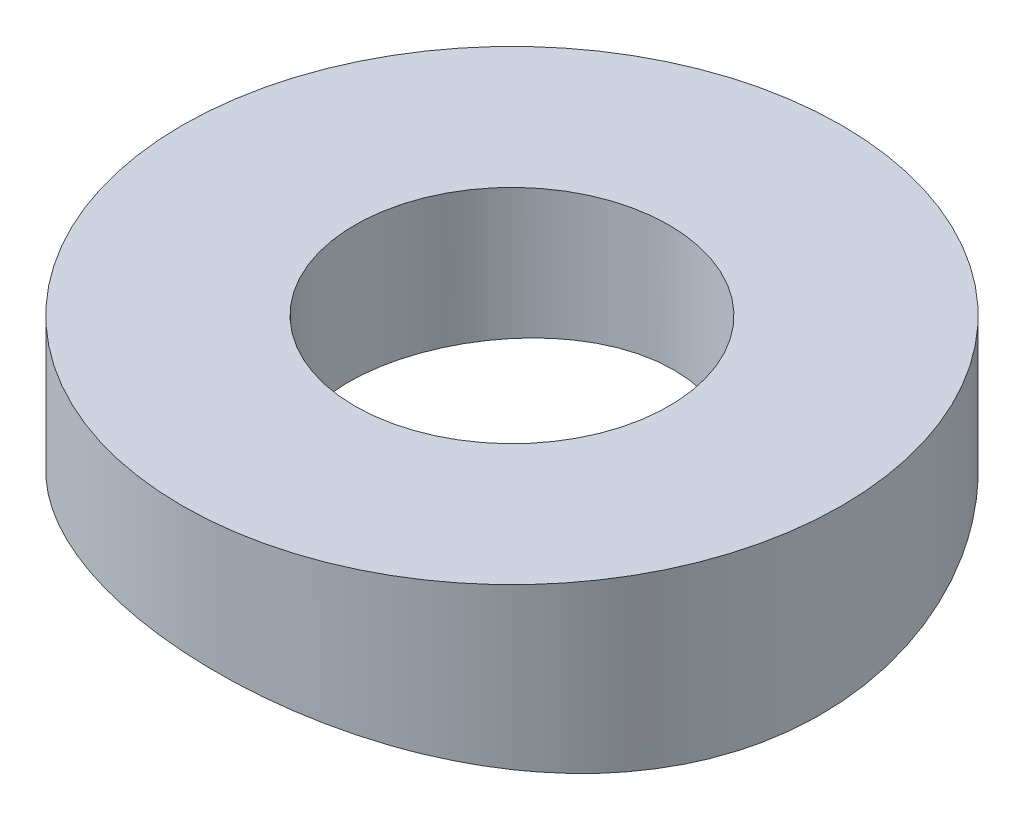
ISO-10303-21;
HEADER;
FILE_DESCRIPTION(('STEP AP214'),'2;1');
FILE_NAME('part.step','',(''),(''),'','','');
FILE_SCHEMA(('AUTOMOTIVE_DESIGN { 1 0 10303 214 1 1 1 1 }'));
ENDSEC;
DATA;
#1=APPLICATION_CONTEXT('core data for automotive mechanical design processes');
#2=APPLICATION_PROTOCOL_DEFINITION('international standard','automotive_design',2000,#1);
#3=PRODUCT_CONTEXT('',#1,'mechanical');
#4=PRODUCT('Part','Part','',(#3));
#5=PRODUCT_RELATED_PRODUCT_CATEGORY('part','',(#4));
#6=PRODUCT_DEFINITION_FORMATION('','',#4);
#7=PRODUCT_DEFINITION_CONTEXT('part definition',#1,'design');
#8=PRODUCT_DEFINITION('design','',#6,#7);
#9=PRODUCT_DEFINITION_SHAPE('','',#8);
#10=(LENGTH_UNIT() NAMED_UNIT(*) SI_UNIT(.MILLI.,.METRE.));
#11=(NAMED_UNIT(*) PLANE_ANGLE_UNIT() SI_UNIT($,.RADIAN.));
#12=(NAMED_UNIT(*) SI_UNIT($,.STERADIAN.) SOLID_ANGLE_UNIT());
#13=UNCERTAINTY_MEASURE_WITH_UNIT(LENGTH_MEASURE(1.E-05),#10,'distance_accuracy_value','');
#14=(GEOMETRIC_REPRESENTATION_CONTEXT(3) GLOBAL_UNCERTAINTY_ASSIGNED_CONTEXT((#13)) GLOBAL_UNIT_ASSIGNED_CONTEXT((#10,
#11,#12)) REPRESENTATION_CONTEXT('',''));
#15=CARTESIAN_POINT('',(0.,0.,0.));
#16=DIRECTION('',(0.,0.,1.));
#17=DIRECTION('',(1.,0.,0.));
#18=AXIS2_PLACEMENT_3D('',#15,#16,#17);
#19=CARTESIAN_POINT('',(0.,0.5,0.));
#20=DIRECTION('',(0.,1.,0.));
#21=DIRECTION('',(0.,0.,1.));
#22=AXIS2_PLACEMENT_3D('',#19,#20,#21);
#23=PLANE('',#22);
#24=CARTESIAN_POINT('',(0.,0.5,0.));
#25=DIRECTION('',(0.,1.,0.));
#26=DIRECTION('',(0.,0.,1.));
#27=AXIS2_PLACEMENT_3D('',#24,#25,#26);
#28=CIRCLE('',#27,5.25);
#29=CARTESIAN_POINT('',(0.,0.5,5.25));
#30=VERTEX_POINT('',#29);
#31=EDGE_CURVE('E10',#30,#30,#28,.T.);
#32=ORIENTED_EDGE('',*,*,#31,.T.);
#33=EDGE_LOOP('',(#32));
#34=FACE_BOUND('',#33,.T.);
#35=CARTESIAN_POINT('',(0.,0.5,0.));
#36=DIRECTION('',(0.,1.,0.));
#37=DIRECTION('',(0.,0.,1.));
#38=AXIS2_PLACEMENT_3D('',#35,#36,#37);
#39=CIRCLE('',#38,2.49999999999838);
#40=CARTESIAN_POINT('',(0.,0.5,2.49999999999838));
#41=VERTEX_POINT('',#40);
#42=EDGE_CURVE('E45',#41,#41,#39,.T.);
#43=ORIENTED_EDGE('',*,*,#42,.F.);
#44=EDGE_LOOP('',(#43));
#45=FACE_BOUND('',#44,.T.);
#46=ADVANCED_FACE('F37',(#34,#45),#23,.T.);
#47=CARTESIAN_POINT('',(0.,0.5,0.));
#48=DIRECTION('',(0.,-1.,0.));
#49=DIRECTION('',(0.,0.,-1.));
#50=AXIS2_PLACEMENT_3D('',#47,#48,#49);
#51=CYLINDRICAL_SURFACE('',#50,5.25);
#52=ORIENTED_EDGE('',*,*,#31,.F.);
#53=EDGE_LOOP('',(#52));
#54=FACE_BOUND('',#53,.T.);
#55=CARTESIAN_POINT('',(0.,-1.50283224713271,5.25));
#56=CARTESIAN_POINT('',(0.147652765710306,-1.51393663326217,5.25000479325287));
#57=CARTESIAN_POINT('',(0.295127762788347,-1.52666987748998,5.24377066254227));
#58=CARTESIAN_POINT('',(0.588800454093382,-1.55503249876174,5.21895703640621));
#59=CARTESIAN_POINT('',(0.734997964226816,-1.57066228623598,5.20037579047069));
#60=CARTESIAN_POINT('',(1.02508219118432,-1.60438800987724,5.15105492497996));
#61=CARTESIAN_POINT('',(1.16896806387974,-1.62248482501899,5.12031096452442));
#62=CARTESIAN_POINT('',(1.45346290778707,-1.66064904462505,5.04693329353771));
#63=CARTESIAN_POINT('',(1.59407061841492,-1.68071719217031,5.00429508832015));
#64=CARTESIAN_POINT('',(1.87077094923852,-1.72223363697337,4.9075600874473));
#65=CARTESIAN_POINT('',(2.00687183377532,-1.74367916862434,4.85348578227901));
#66=CARTESIAN_POINT('',(2.27399203203094,-1.78740750907438,4.73422534110709));
#67=CARTESIAN_POINT('',(2.40500945697319,-1.80969062313906,4.66903512257355));
#68=CARTESIAN_POINT('',(2.78907255211977,-1.87687892246193,4.45744748321791));
#69=CARTESIAN_POINT('',(3.03341864263701,-1.92216844825496,4.29493144745056));
#70=CARTESIAN_POINT('',(3.49658693796118,-2.00960958060768,3.92754171507278));
#71=CARTESIAN_POINT('',(3.71480358492105,-2.05168068566105,3.72188857441577));
#72=CARTESIAN_POINT('',(4.11378301744051,-2.12667965653291,3.27548463574664));
#73=CARTESIAN_POINT('',(4.29455203022198,-2.15960904285146,3.03473968456475));
#74=CARTESIAN_POINT('',(4.60957542032394,-2.21162017824754,2.53002011854625));
#75=CARTESIAN_POINT('',(4.74470226299247,-2.23097033048144,2.26661856057025));
#76=CARTESIAN_POINT('',(4.96892316468542,-2.25439894156032,1.72029516885201));
#77=CARTESIAN_POINT('',(5.05803054477787,-2.25848182189877,1.43737901083204));
#78=CARTESIAN_POINT('',(5.18477825878008,-2.25100683329315,0.872383700755164));
#79=CARTESIAN_POINT('',(5.22433390346927,-2.24006778566312,0.590723341511633));
#80=CARTESIAN_POINT('',(5.25756524796937,-2.20497127693655,0.0255478489936507));
#81=CARTESIAN_POINT('',(5.25123848557693,-2.18081310652201,-0.257967383003788));
#82=CARTESIAN_POINT('',(5.19323409739095,-2.12195032152321,-0.820454763689445));
#83=CARTESIAN_POINT('',(5.14135173467222,-2.0871985578714,-1.09940060409208));
#84=CARTESIAN_POINT('',(4.99378395906723,-2.01101731901197,-1.64450618888744));
#85=CARTESIAN_POINT('',(4.89808833371829,-1.96958628838908,-1.91066293627105));
#86=CARTESIAN_POINT('',(4.66061034907422,-1.8825848833207,-2.43461220861466));
#87=CARTESIAN_POINT('',(4.51707397663303,-1.83691396741706,-2.69159425015787));
#88=CARTESIAN_POINT('',(4.1888979980221,-1.74797450362881,-3.17833351595849));
#89=CARTESIAN_POINT('',(4.00425331161295,-1.70470625349641,-3.40808736992543));
#90=CARTESIAN_POINT('',(3.59524928665211,-1.62463045358851,-3.83743398200973));
#91=CARTESIAN_POINT('',(3.37032290430443,-1.58793248344051,-4.03650861489725));
#92=CARTESIAN_POINT('',(2.88880314955733,-1.52600059766014,-4.39399202680978));
#93=CARTESIAN_POINT('',(2.63221772504671,-1.50076381215503,-4.5524109816628));
#94=CARTESIAN_POINT('',(2.10347903201642,-1.46526125354077,-4.81899595162568));
#95=CARTESIAN_POINT('',(1.83208296299062,-1.45454380333699,-4.92860317476767));
#96=CARTESIAN_POINT('',(1.27471304832574,-1.44779971171288,-5.10124321269341));
#97=CARTESIAN_POINT('',(0.98874184650722,-1.45177041525822,-5.16428444228643));
#98=CARTESIAN_POINT('',(0.419201397773205,-1.4736254399165,-5.24089521025491));
#99=CARTESIAN_POINT('',(0.135798791195952,-1.49110714452453,-5.2558327409671));
#100=CARTESIAN_POINT('',(-0.428755477906114,-1.53765970958948,-5.24007962450734));
#101=CARTESIAN_POINT('',(-0.709906945603988,-1.56673156230041,-5.20938507007405));
#102=CARTESIAN_POINT('',(-1.26714479723721,-1.63405032217261,-5.10280615322116));
#103=CARTESIAN_POINT('',(-1.54307448293746,-1.67243873354295,-5.02619509797609));
#104=CARTESIAN_POINT('',(-2.07824260100166,-1.75420595863635,-4.82956781505799));
#105=CARTESIAN_POINT('',(-2.33747691740768,-1.79758599566959,-4.70954093184465));
#106=CARTESIAN_POINT('',(-2.84253314110295,-1.8866029837088,-4.42378337554925));
#107=CARTESIAN_POINT('',(-3.08746338840706,-1.9322628144159,-4.25648084332879));
#108=CARTESIAN_POINT('',(-3.54620432727373,-2.01911737370939,-3.88258867583062));
#109=CARTESIAN_POINT('',(-3.76001331738729,-2.06031185813674,-3.67599689396986));
#110=CARTESIAN_POINT('',(-4.15124743859227,-2.13355998700734,-3.22776690189872));
#111=CARTESIAN_POINT('',(-4.32851470161876,-2.16557419415283,-2.98598402091961));
#112=CARTESIAN_POINT('',(-4.63977698517769,-2.21617368607563,-2.47476174005913));
#113=CARTESIAN_POINT('',(-4.77378674486611,-2.23476354761514,-2.20533180170195));
#114=CARTESIAN_POINT('',(-4.98962642584803,-2.25563573606303,-1.65807378559484));
#115=CARTESIAN_POINT('',(-5.07331160959048,-2.25853436455062,-1.38100013227663));
#116=CARTESIAN_POINT('',(-5.1940249427223,-2.24932116606658,-0.817135469855133));
#117=CARTESIAN_POINT('',(-5.23105774282904,-2.23721083555797,-0.53034543229344));
#118=CARTESIAN_POINT('',(-5.25741307367904,-2.19989909733474,0.0383954010539523));
#119=CARTESIAN_POINT('',(-5.24772684552044,-2.17497961007166,0.320320458929155));
#120=CARTESIAN_POINT('',(-5.18367483512661,-2.11507133831735,0.877952874975825));
#121=CARTESIAN_POINT('',(-5.12930138815035,-2.08008082711556,1.15365915816889));
#122=CARTESIAN_POINT('',(-4.97536910530781,-2.00262470810087,1.70041032759132));
#123=CARTESIAN_POINT('',(-4.87446189294901,-1.95996101310665,1.9710458180013));
#124=CARTESIAN_POINT('',(-4.62979210422877,-1.87253238046081,2.49204234150143));
#125=CARTESIAN_POINT('',(-4.48601997969042,-1.82776697652644,2.742398841621));
#126=CARTESIAN_POINT('',(-4.23822695668057,-1.76183597842736,3.1019675652115));
#127=CARTESIAN_POINT('',(-4.14844605688129,-1.73969503211196,3.22104915415993));
#128=CARTESIAN_POINT('',(-3.95896493562291,-1.69672516274637,3.45127330671804));
#129=CARTESIAN_POINT('',(-3.85926837416428,-1.67589576019035,3.56241877382166));
#130=CARTESIAN_POINT('',(-3.65054502909402,-1.63612488304628,3.77602129608223));
#131=CARTESIAN_POINT('',(-3.54151448885923,-1.61718417529859,3.8784748196722));
#132=CARTESIAN_POINT('',(-3.31491965357565,-1.58174292005662,4.07383999162318));
#133=CARTESIAN_POINT('',(-3.19735896004393,-1.56524135156821,4.1667556274238));
#134=CARTESIAN_POINT('',(-2.95596881799948,-1.53532911163889,4.34127355993746));
#135=CARTESIAN_POINT('',(-2.83223419109465,-1.52188293915798,4.42300088468183));
#136=CARTESIAN_POINT('',(-2.57811570680729,-1.49821255114927,4.57578314344685));
#137=CARTESIAN_POINT('',(-2.44773455057756,-1.48798703868227,4.64684236739509));
#138=CARTESIAN_POINT('',(-2.18127615134274,-1.47105033900093,4.77771385197785));
#139=CARTESIAN_POINT('',(-2.04520107032395,-1.46433783074151,4.83753033494996));
#140=CARTESIAN_POINT('',(-1.76839711387578,-1.45461389936946,4.94543797148374));
#141=CARTESIAN_POINT('',(-1.62766878962834,-1.45160203951212,4.99353050815003));
#142=CARTESIAN_POINT('',(-1.24428198577865,-1.44861639941599,5.1065838111067));
#143=CARTESIAN_POINT('',(-0.99818892274556,-1.4521647584509,5.16034237157682));
#144=CARTESIAN_POINT('',(-0.501226942785609,-1.46985835408988,5.23204676965219));
#145=CARTESIAN_POINT('',(-0.250357927997903,-1.48400380806023,5.24999187262866));
#146=CARTESIAN_POINT('',(0.,-1.50283224713271,5.25));
#147=B_SPLINE_CURVE_WITH_KNOTS('',3,(#55,#56,#57,#58,#59,#60,#61,#62,#63,#64,#65,#66,#67,#68,
#69,#70,#71,#72,#73,#74,#75,#76,#77,#78,#79,#80,#81,#82,#83,#84,#85,#86,#87,#88,#89,#90,#91,#92,
#93,#94,#95,#96,#97,#98,#99,#100,#101,#102,#103,#104,#105,#106,#107,#108,#109,#110,#111,#112,
#113,#114,#115,#116,#117,#118,#119,#120,#121,#122,#123,#124,#125,#126,#127,#128,#129,#130,#131,
#132,#133,#134,#135,#136,#137,#138,#139,#140,#141,#142,#143,#144,#145,#146),.UNSPECIFIED.,.T.,
.F.,(4,2,2,2,2,2,2,2,2,2,2,2,2,2,2,2,2,2,2,2,2,2,2,2,2,2,2,2,2,2,2,2,2,2,2,2,2,2,2,2,2,2,2,2,2,
4),(0.,0.443977148082651,0.888017254380359,1.33221598277543,1.77658279623435,2.22008370204813,
2.66374784419911,3.550156637562,4.45422681571982,5.35814653382889,6.24365410091631,
7.12890519983242,7.97876221204383,8.82866483076099,9.68240676287434,10.5363477956576,
11.4258668100482,12.3154958138795,13.2188049361487,14.1218877455556,14.9961768799306,
15.8703079853066,16.7193499794243,17.5684646772116,18.4313863989966,19.2945200513933,
20.1906519292997,21.0868327817844,21.986807733259,22.8864757112242,23.7505365408833,
24.6145112265886,25.4602365416933,26.3061069456816,27.1781969516142,28.0504813612757,
28.502339029809,28.9540305264197,29.405904676603,29.8575891388128,30.3037213258282,
30.749673627884,31.1954581114194,31.6411899791153,32.3939758708094,33.1467772039756),.UNSPECIFIED.);
#148=CARTESIAN_POINT('',(0.,-1.50283224713271,5.25));
#149=VERTEX_POINT('',#148);
#150=EDGE_CURVE('E57',#149,#149,#147,.T.);
#151=ORIENTED_EDGE('',*,*,#150,.T.);
#152=EDGE_LOOP('',(#151));
#153=FACE_BOUND('',#152,.T.);
#154=ADVANCED_FACE('F39',(#54,#153),#51,.T.);
#155=CARTESIAN_POINT('',(0.,0.5,0.));
#156=DIRECTION('',(0.,-1.,0.));
#157=DIRECTION('',(0.,0.,-1.));
#158=AXIS2_PLACEMENT_3D('',#155,#156,#157);
#159=CYLINDRICAL_SURFACE('',#158,2.49999999999838);
#160=ORIENTED_EDGE('',*,*,#42,.T.);
#161=EDGE_LOOP('',(#160));
#162=FACE_BOUND('',#161,.T.);
#163=CARTESIAN_POINT('',(0.,-1.46196610857536,2.49999999999838));
#164=CARTESIAN_POINT('',(0.140470364218208,-1.46698804409764,2.49999417829248));
#165=CARTESIAN_POINT('',(0.280974341060903,-1.47349046657698,2.48812165829915));
#166=CARTESIAN_POINT('',(0.557981582243768,-1.48873464586083,2.4409911450548));
#167=CARTESIAN_POINT('',(0.694480321661717,-1.49747883437423,2.40570769086061));
#168=CARTESIAN_POINT('',(0.95946296025064,-1.51621733903422,2.31281661665283));
#169=CARTESIAN_POINT('',(1.08795255864686,-1.52621075066878,2.25522508632974));
#170=CARTESIAN_POINT('',(1.33343060964942,-1.54633648094252,2.11934958462091));
#171=CARTESIAN_POINT('',(1.45042130714312,-1.55646877202692,2.04106966320418));
#172=CARTESIAN_POINT('',(1.6701693087071,-1.57578237311672,1.86558038079526));
#173=CARTESIAN_POINT('',(1.77286196004835,-1.58495931894086,1.76828953161828));
#174=CARTESIAN_POINT('',(1.96047049395343,-1.60126337260419,1.55770337094314));
#175=CARTESIAN_POINT('',(2.04538645582268,-1.60839048958813,1.4444081308476));
#176=CARTESIAN_POINT('',(2.19460010732371,-1.61974238671432,1.20559458846543));
#177=CARTESIAN_POINT('',(2.25899504687868,-1.62398096802165,1.08013772765399));
#178=CARTESIAN_POINT('',(2.36582415361848,-1.62911836681179,0.820137874194329));
#179=CARTESIAN_POINT('',(2.40825964903966,-1.63001738631126,0.685595431652151));
#180=CARTESIAN_POINT('',(2.46966579861413,-1.62837865391994,0.412514212005522));
#181=CARTESIAN_POINT('',(2.488837287556,-1.62587071923329,0.274020359374918));
#182=CARTESIAN_POINT('',(2.50387351975846,-1.61775858524573,-0.00413372667384024));
#183=CARTESIAN_POINT('',(2.49973809803221,-1.61215436402683,-0.143793968341736));
#184=CARTESIAN_POINT('',(2.4683164144177,-1.59847851837837,-0.420505939546786));
#185=CARTESIAN_POINT('',(2.4410056204865,-1.59040428513797,-0.557554747540602));
#186=CARTESIAN_POINT('',(2.36401541623247,-1.57269598996446,-0.825113989710893));
#187=CARTESIAN_POINT('',(2.3143346405764,-1.56306183284569,-0.955624024258386));
#188=CARTESIAN_POINT('',(2.19344254362561,-1.54321010577422,-1.2076943662853));
#189=CARTESIAN_POINT('',(2.12203844764318,-1.53298800557986,-1.32916189584458));
#190=CARTESIAN_POINT('',(1.95984191627014,-1.51318513593587,-1.55844138277389));
#191=CARTESIAN_POINT('',(1.86904907784175,-1.50360437982343,-1.6662530562026));
#192=CARTESIAN_POINT('',(1.67027214886788,-1.48612806530482,-1.86548949174515));
#193=CARTESIAN_POINT('',(1.56223665360555,-1.47823771659517,-1.9568634593414));
#194=CARTESIAN_POINT('',(1.33221111186618,-1.46507078209653,-2.12016635821112));
#195=CARTESIAN_POINT('',(1.21022182391018,-1.45979405431549,-2.19209634573519));
#196=CARTESIAN_POINT('',(0.956758548646715,-1.45248153599702,-2.31392154470885));
#197=CARTESIAN_POINT('',(0.825364337067133,-1.45042123919967,-2.3639812577261));
#198=CARTESIAN_POINT('',(0.556045148228915,-1.44969606052153,-2.44140195634057));
#199=CARTESIAN_POINT('',(0.418120446532146,-1.45103103549826,-2.46876389879676));
#200=CARTESIAN_POINT('',(0.140600339255474,-1.4569266439765,-2.49992122454493));
#201=CARTESIAN_POINT('',(0.0010211839644331,-1.46146666513029,-2.50386569341094));
#202=CARTESIAN_POINT('',(-0.276737826910886,-1.47324712445725,-2.48852655208414));
#203=CARTESIAN_POINT('',(-0.414917639316031,-1.48048764569979,-2.46924222731588));
#204=CARTESIAN_POINT('',(-0.686685436206362,-1.49691170789968,-2.40789536517712));
#205=CARTESIAN_POINT('',(-0.820248815898902,-1.50610421181422,-2.36572630818762));
#206=CARTESIAN_POINT('',(-1.07842836431389,-1.52539746848981,-2.25974933930844));
#207=CARTESIAN_POINT('',(-1.20304400948902,-1.5354982743194,-2.19594016246634));
#208=CARTESIAN_POINT('',(-1.44093731568257,-1.55557960847827,-2.04780395877706));
#209=CARTESIAN_POINT('',(-1.5541082001371,-1.56555835420233,-1.96330512093113));
#210=CARTESIAN_POINT('',(-1.76469710399325,-1.58417832408806,-1.7764183117917));
#211=CARTESIAN_POINT('',(-1.8621152030447,-1.59281955501252,-1.67403043095489));
#212=CARTESIAN_POINT('',(-2.0383402177321,-1.60777066522376,-1.45429939890458));
#213=CARTESIAN_POINT('',(-2.11716130457227,-1.61408232176481,-1.33696774074812));
#214=CARTESIAN_POINT('',(-2.25397353947481,-1.62365187688596,-1.09061957498543));
#215=CARTESIAN_POINT('',(-2.31196606598319,-1.62690997757511,-0.96160384134585));
#216=CARTESIAN_POINT('',(-2.40498262390656,-1.62997779221998,-0.69682815467624));
#217=CARTESIAN_POINT('',(-2.44021107331898,-1.6298186487152,-0.561140343761175));
#218=CARTESIAN_POINT('',(-2.48752992450392,-1.62614719898204,-0.285835841477805));
#219=CARTESIAN_POINT('',(-2.49962072639166,-1.62263495073987,-0.146219218092119));
#220=CARTESIAN_POINT('',(-2.50036051878185,-1.61267709285148,0.132517626403148));
#221=CARTESIAN_POINT('',(-2.48908414370109,-1.60624087359558,0.271638010653189));
#222=CARTESIAN_POINT('',(-2.44361640751974,-1.59116453179811,0.54595924484695));
#223=CARTESIAN_POINT('',(-2.40942386330216,-1.58252429548171,0.681159892046316));
#224=CARTESIAN_POINT('',(-2.31876327223659,-1.56392979573209,0.944954361547566));
#225=CARTESIAN_POINT('',(-2.26212490119839,-1.55396588150534,1.07348896340299));
#226=CARTESIAN_POINT('',(-2.12816893880757,-1.53388934457203,1.3192751282706));
#227=CARTESIAN_POINT('',(-2.05085104388703,-1.5237767196845,1.43652652561505));
#228=CARTESIAN_POINT('',(-1.87708721148787,-1.50446241166113,1.65722554629321));
#229=CARTESIAN_POINT('',(-1.7805198010685,-1.49526710034239,1.76057814660655));
#230=CARTESIAN_POINT('',(-1.57124084733781,-1.4788970997117,1.9496375553301));
#231=CARTESIAN_POINT('',(-1.45852657147359,-1.47172275302078,2.03534137101992));
#232=CARTESIAN_POINT('',(-1.22067927240301,-1.46023294091637,2.18625268201131));
#233=CARTESIAN_POINT('',(-1.09560137244774,-1.45590539050731,2.25154619318573));
#234=CARTESIAN_POINT('',(-0.836281731083147,-1.45055521160354,2.36015932005186));
#235=CARTESIAN_POINT('',(-0.702049900688243,-1.44952906490059,2.40350228624365));
#236=CARTESIAN_POINT('',(-0.472616455269408,-1.45065944394034,2.45676501940416));
#237=CARTESIAN_POINT('',(-0.378816703696616,-1.45189479351909,2.47295904573764));
#238=CARTESIAN_POINT('',(-0.190016421106571,-1.45584968216508,2.4945784605223));
#239=CARTESIAN_POINT('',(-0.0950159000087139,-1.45856920897955,2.5000039378726));
#240=CARTESIAN_POINT('',(0.,-1.46196610857536,2.49999999999838));
#241=B_SPLINE_CURVE_WITH_KNOTS('',3,(#163,#164,#165,#166,#167,#168,#169,#170,#171,#172,#173,
#174,#175,#176,#177,#178,#179,#180,#181,#182,#183,#184,#185,#186,#187,#188,#189,#190,#191,#192,
#193,#194,#195,#196,#197,#198,#199,#200,#201,#202,#203,#204,#205,#206,#207,#208,#209,#210,#211,
#212,#213,#214,#215,#216,#217,#218,#219,#220,#221,#222,#223,#224,#225,#226,#227,#228,#229,#230,
#231,#232,#233,#234,#235,#236,#237,#238,#239,#240),.UNSPECIFIED.,.T.,.F.,(4,2,2,2,2,2,2,2,2,2,2,
2,2,2,2,2,2,2,2,2,2,2,2,2,2,2,2,2,2,2,2,2,2,2,2,2,2,2,4),(0.,0.421331552274892,
0.843122083281091,1.2646089628037,1.6860133928977,2.10926539905357,2.5325155169563,
2.9537289327304,3.37491686806058,3.79244227322,4.20997063399578,4.6279415170805,
5.04593791412921,5.46775755108712,5.88958595735021,6.31269627531716,6.7357836041443,
7.1556313832645,7.5754614621647,7.99261583375668,8.40978303838244,8.82890886141555,
9.24805918826993,9.67081586586905,10.0935704058434,10.516001752456,10.9384051371672,
11.3569606597463,11.775508944254,12.1927224524804,12.6099575022836,13.0304211876169,
13.4508910455439,13.8741034092743,14.2973874785212,14.7188628566226,15.1398889318525,
15.4248851825567,15.7098790804815),.UNSPECIFIED.);
#242=CARTESIAN_POINT('',(0.,-1.46196610857536,2.49999999999838));
#243=VERTEX_POINT('',#242);
#244=EDGE_CURVE('E51',#243,#243,#241,.T.);
#245=ORIENTED_EDGE('',*,*,#244,.F.);
#246=EDGE_LOOP('',(#245));
#247=FACE_BOUND('',#246,.T.);
#248=ADVANCED_FACE('F73',(#162,#247),#159,.F.);
#249=CARTESIAN_POINT('',(-61.6895194001878,-18.949999999971,230.228420695998));
#250=DIRECTION('',(0.258819045102522,0.,-0.965925826289068));
#251=DIRECTION('',(0.965925826289068,0.,0.258819045102521));
#252=AXIS2_PLACEMENT_3D('',#249,#250,#251);
#253=CYLINDRICAL_SURFACE('',#252,17.5);
#254=ORIENTED_EDGE('',*,*,#150,.F.);
#255=EDGE_LOOP('',(#254));
#256=FACE_BOUND('',#255,.T.);
#257=ORIENTED_EDGE('',*,*,#244,.T.);
#258=EDGE_LOOP('',(#257));
#259=FACE_BOUND('',#258,.T.);
#260=ADVANCED_FACE('F70',(#256,#259),#253,.F.);
#261=CLOSED_SHELL('',(#46,#154,#248,#260));
#262=MANIFOLD_SOLID_BREP('B2',#261);
#263=ADVANCED_BREP_SHAPE_REPRESENTATION('',(#18,#262),#14);
#264=SHAPE_DEFINITION_REPRESENTATION(#9,#263);
ENDSEC;
END-ISO-10303-21;
